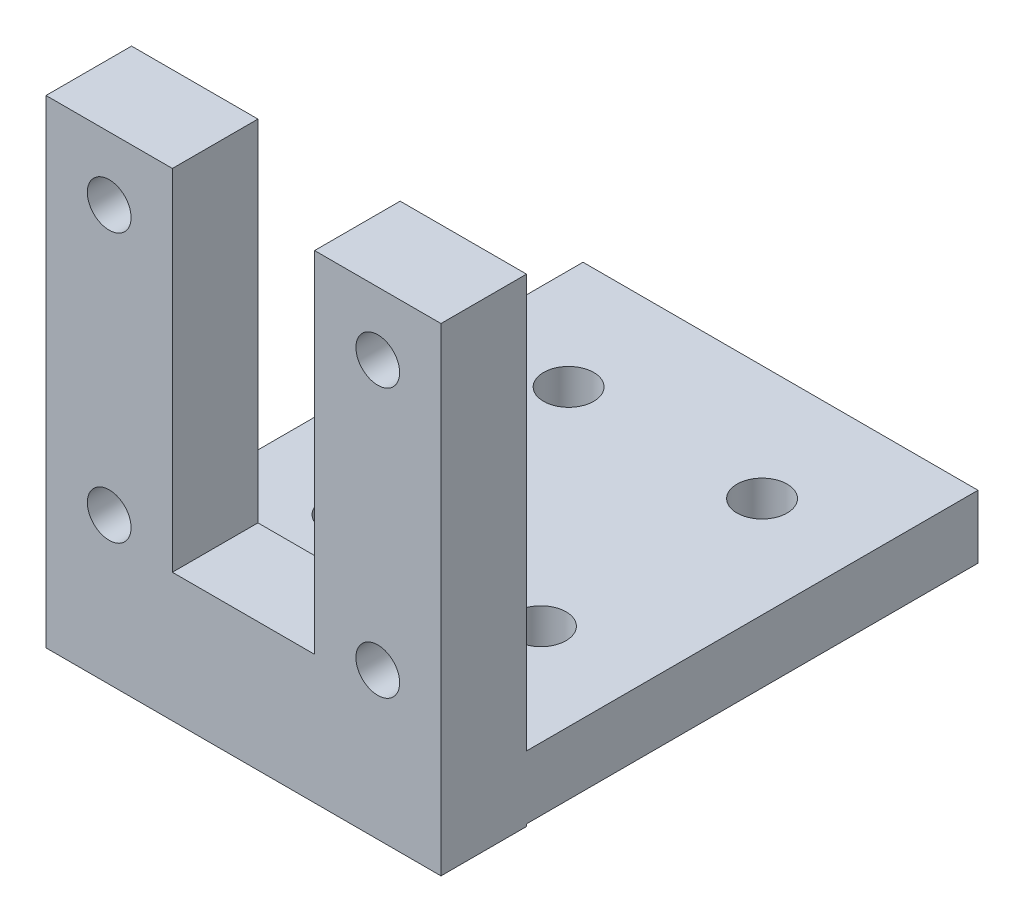
ISO-10303-21;
HEADER;
FILE_DESCRIPTION(('STEP AP214'),'2;1');
FILE_NAME('part.step','',(''),(''),'','','');
FILE_SCHEMA(('AUTOMOTIVE_DESIGN { 1 0 10303 214 1 1 1 1 }'));
ENDSEC;
DATA;
#1=APPLICATION_CONTEXT('core data for automotive mechanical design processes');
#2=APPLICATION_PROTOCOL_DEFINITION('international standard','automotive_design',2000,#1);
#3=PRODUCT_CONTEXT('',#1,'mechanical');
#4=PRODUCT('Part','Part','',(#3));
#5=PRODUCT_RELATED_PRODUCT_CATEGORY('part','',(#4));
#6=PRODUCT_DEFINITION_FORMATION('','',#4);
#7=PRODUCT_DEFINITION_CONTEXT('part definition',#1,'design');
#8=PRODUCT_DEFINITION('design','',#6,#7);
#9=PRODUCT_DEFINITION_SHAPE('','',#8);
#10=(LENGTH_UNIT() NAMED_UNIT(*) SI_UNIT(.MILLI.,.METRE.));
#11=(NAMED_UNIT(*) PLANE_ANGLE_UNIT() SI_UNIT($,.RADIAN.));
#12=(NAMED_UNIT(*) SI_UNIT($,.STERADIAN.) SOLID_ANGLE_UNIT());
#13=UNCERTAINTY_MEASURE_WITH_UNIT(LENGTH_MEASURE(1.E-05),#10,'distance_accuracy_value','');
#14=(GEOMETRIC_REPRESENTATION_CONTEXT(3) GLOBAL_UNCERTAINTY_ASSIGNED_CONTEXT((#13)) GLOBAL_UNIT_ASSIGNED_CONTEXT((#10,
#11,#12)) REPRESENTATION_CONTEXT('',''));
#15=CARTESIAN_POINT('',(0.,0.,0.));
#16=DIRECTION('',(0.,0.,1.));
#17=DIRECTION('',(1.,0.,0.));
#18=AXIS2_PLACEMENT_3D('',#15,#16,#17);
#19=CARTESIAN_POINT('',(-12.5,-9.635,-5.415));
#20=DIRECTION('',(0.,1.,0.));
#21=DIRECTION('',(0.,0.,1.));
#22=AXIS2_PLACEMENT_3D('',#19,#20,#21);
#23=PLANE('',#22);
#24=DIRECTION('',(0.,0.,1.));
#25=VECTOR('',#24,1.);
#26=CARTESIAN_POINT('',(4.5,-9.635,-28.9513171503105));
#27=LINE('',#26,#25);
#28=CARTESIAN_POINT('',(4.5,-9.635,-5.415));
#29=VERTEX_POINT('',#28);
#30=CARTESIAN_POINT('',(4.49999999999999,-9.635,0.));
#31=VERTEX_POINT('',#30);
#32=EDGE_CURVE('E152',#29,#31,#27,.T.);
#33=ORIENTED_EDGE('',*,*,#32,.F.);
#34=DIRECTION('',(-1.,0.,0.));
#35=VECTOR('',#34,1.);
#36=CARTESIAN_POINT('',(-12.5,-9.635,-5.415));
#37=LINE('',#36,#35);
#38=CARTESIAN_POINT('',(-4.49999999999999,-9.635,-5.415));
#39=VERTEX_POINT('',#38);
#40=EDGE_CURVE('E245',#29,#39,#37,.T.);
#41=ORIENTED_EDGE('',*,*,#40,.T.);
#42=DIRECTION('',(0.,0.,1.));
#43=VECTOR('',#42,1.);
#44=CARTESIAN_POINT('',(-4.49999999999999,-9.635,-28.9513171503105));
#45=LINE('',#44,#43);
#46=CARTESIAN_POINT('',(-4.49999999999999,-9.635,0.));
#47=VERTEX_POINT('',#46);
#48=EDGE_CURVE('E175',#39,#47,#45,.T.);
#49=ORIENTED_EDGE('',*,*,#48,.T.);
#50=DIRECTION('',(-1.,0.,0.));
#51=VECTOR('',#50,1.);
#52=CARTESIAN_POINT('',(-12.5,-9.635,0.));
#53=LINE('',#52,#51);
#54=EDGE_CURVE('E53',#31,#47,#53,.T.);
#55=ORIENTED_EDGE('',*,*,#54,.F.);
#56=EDGE_LOOP('',(#33,#41,#49,#55));
#57=FACE_BOUND('',#56,.T.);
#58=ADVANCED_FACE('F33',(#57),#23,.T.);
#59=CARTESIAN_POINT('',(0.,0.,-5.415));
#60=DIRECTION('',(0.,0.,1.));
#61=DIRECTION('',(1.,0.,0.));
#62=AXIS2_PLACEMENT_3D('',#59,#60,#61);
#63=PLANE('',#62);
#64=CARTESIAN_POINT('',(-8.5,-8.49999999999999,-5.415));
#65=DIRECTION('',(0.,0.,1.));
#66=DIRECTION('',(1.,0.,0.));
#67=AXIS2_PLACEMENT_3D('',#64,#65,#66);
#68=CIRCLE('',#67,1.3843);
#69=CARTESIAN_POINT('',(-7.1157,-8.49999999999999,-5.415));
#70=VERTEX_POINT('',#69);
#71=EDGE_CURVE('E329',#70,#70,#68,.F.);
#72=ORIENTED_EDGE('',*,*,#71,.F.);
#73=EDGE_LOOP('',(#72));
#74=FACE_BOUND('',#73,.T.);
#75=CARTESIAN_POINT('',(8.5,-8.5,-5.415));
#76=DIRECTION('',(0.,0.,1.));
#77=DIRECTION('',(1.,0.,0.));
#78=AXIS2_PLACEMENT_3D('',#75,#76,#77);
#79=CIRCLE('',#78,1.3843);
#80=CARTESIAN_POINT('',(9.8843,-8.5,-5.415));
#81=VERTEX_POINT('',#80);
#82=EDGE_CURVE('E148',#81,#81,#79,.F.);
#83=ORIENTED_EDGE('',*,*,#82,.F.);
#84=EDGE_LOOP('',(#83));
#85=FACE_BOUND('',#84,.T.);
#86=DIRECTION('',(1.,0.,0.));
#87=VECTOR('',#86,1.);
#88=CARTESIAN_POINT('',(12.5,-13.635,-5.415));
#89=LINE('',#88,#87);
#90=CARTESIAN_POINT('',(-12.5,-13.635,-5.415));
#91=VERTEX_POINT('',#90);
#92=CARTESIAN_POINT('',(12.5,-13.635,-5.415));
#93=VERTEX_POINT('',#92);
#94=EDGE_CURVE('E213',#91,#93,#89,.T.);
#95=ORIENTED_EDGE('',*,*,#94,.F.);
#96=DIRECTION('',(0.,-1.,0.));
#97=VECTOR('',#96,1.);
#98=CARTESIAN_POINT('',(-12.5,-9.635,-5.415));
#99=LINE('',#98,#97);
#100=CARTESIAN_POINT('',(-12.5,12.5,-5.415));
#101=VERTEX_POINT('',#100);
#102=EDGE_CURVE('E235',#101,#91,#99,.T.);
#103=ORIENTED_EDGE('',*,*,#102,.F.);
#104=DIRECTION('',(1.,0.,0.));
#105=VECTOR('',#104,1.);
#106=CARTESIAN_POINT('',(-12.5,12.5,-5.415));
#107=LINE('',#106,#105);
#108=CARTESIAN_POINT('',(-4.49999999999999,12.5,-5.415));
#109=VERTEX_POINT('',#108);
#110=EDGE_CURVE('E164',#101,#109,#107,.T.);
#111=ORIENTED_EDGE('',*,*,#110,.T.);
#112=DIRECTION('',(0.,-1.,0.));
#113=VECTOR('',#112,1.);
#114=CARTESIAN_POINT('',(-4.49999999999999,-9.635,-5.415));
#115=LINE('',#114,#113);
#116=EDGE_CURVE('E161',#109,#39,#115,.T.);
#117=ORIENTED_EDGE('',*,*,#116,.T.);
#118=ORIENTED_EDGE('',*,*,#40,.F.);
#119=DIRECTION('',(0.,1.,0.));
#120=VECTOR('',#119,1.);
#121=CARTESIAN_POINT('',(4.5,-9.635,-5.415));
#122=LINE('',#121,#120);
#123=CARTESIAN_POINT('',(4.49999999999999,12.5,-5.415));
#124=VERTEX_POINT('',#123);
#125=EDGE_CURVE('E160',#29,#124,#122,.T.);
#126=ORIENTED_EDGE('',*,*,#125,.T.);
#127=DIRECTION('',(1.,0.,0.));
#128=VECTOR('',#127,1.);
#129=CARTESIAN_POINT('',(12.5,12.5,-5.415));
#130=LINE('',#129,#128);
#131=CARTESIAN_POINT('',(12.5,12.5,-5.415));
#132=VERTEX_POINT('',#131);
#133=EDGE_CURVE('E154',#124,#132,#130,.T.);
#134=ORIENTED_EDGE('',*,*,#133,.T.);
#135=DIRECTION('',(0.,1.,0.));
#136=VECTOR('',#135,1.);
#137=CARTESIAN_POINT('',(12.5,-9.635,-5.415));
#138=LINE('',#137,#136);
#139=EDGE_CURVE('E136',#93,#132,#138,.T.);
#140=ORIENTED_EDGE('',*,*,#139,.F.);
#141=EDGE_LOOP('',(#95,#103,#111,#117,#118,#126,#134,#140));
#142=FACE_BOUND('',#141,.T.);
#143=CARTESIAN_POINT('',(-8.49999999999999,8.49999999999999,-5.415));
#144=DIRECTION('',(0.,0.,1.));
#145=DIRECTION('',(1.,0.,0.));
#146=AXIS2_PLACEMENT_3D('',#143,#144,#145);
#147=CIRCLE('',#146,1.3843);
#148=CARTESIAN_POINT('',(-7.1157,8.49999999999999,-5.415));
#149=VERTEX_POINT('',#148);
#150=EDGE_CURVE('E167',#149,#149,#147,.F.);
#151=ORIENTED_EDGE('',*,*,#150,.F.);
#152=EDGE_LOOP('',(#151));
#153=FACE_BOUND('',#152,.T.);
#154=CARTESIAN_POINT('',(8.49999999999999,8.49999999999999,-5.415));
#155=DIRECTION('',(0.,0.,1.));
#156=DIRECTION('',(1.,0.,0.));
#157=AXIS2_PLACEMENT_3D('',#154,#155,#156);
#158=CIRCLE('',#157,1.3843);
#159=CARTESIAN_POINT('',(9.88429999999999,8.49999999999999,-5.415));
#160=VERTEX_POINT('',#159);
#161=EDGE_CURVE('E156',#160,#160,#158,.F.);
#162=ORIENTED_EDGE('',*,*,#161,.F.);
#163=EDGE_LOOP('',(#162));
#164=FACE_BOUND('',#163,.T.);
#165=ADVANCED_FACE('F271',(#74,#85,#142,#153,#164),#63,.F.);
#166=DIRECTION('',(-1.,0.,0.));
#167=VECTOR('',#166,1.);
#168=CARTESIAN_POINT('',(12.5,-17.635,-5.415));
#169=LINE('',#168,#167);
#170=CARTESIAN_POINT('',(12.5,-17.635,-5.415));
#171=VERTEX_POINT('',#170);
#172=CARTESIAN_POINT('',(-12.5,-17.635,-5.415));
#173=VERTEX_POINT('',#172);
#174=EDGE_CURVE('E208',#171,#173,#169,.T.);
#175=ORIENTED_EDGE('',*,*,#174,.F.);
#176=CARTESIAN_POINT('',(12.5,-17.7804600070463,-5.415));
#177=VERTEX_POINT('',#176);
#178=EDGE_CURVE('E242',#177,#171,#138,.T.);
#179=ORIENTED_EDGE('',*,*,#178,.F.);
#180=DIRECTION('',(1.,0.,0.));
#181=VECTOR('',#180,1.);
#182=CARTESIAN_POINT('',(-12.5,-17.7804600070463,-5.415));
#183=LINE('',#182,#181);
#184=CARTESIAN_POINT('',(-12.5,-17.7804600070463,-5.415));
#185=VERTEX_POINT('',#184);
#186=EDGE_CURVE('E238',#185,#177,#183,.T.);
#187=ORIENTED_EDGE('',*,*,#186,.F.);
#188=EDGE_CURVE('E239',#173,#185,#99,.T.);
#189=ORIENTED_EDGE('',*,*,#188,.F.);
#190=EDGE_LOOP('',(#175,#179,#187,#189));
#191=FACE_BOUND('',#190,.T.);
#192=ADVANCED_FACE('F258',(#191),#63,.F.);
#193=CARTESIAN_POINT('',(-12.5,-9.635,-5.415));
#194=DIRECTION('',(-1.,0.,0.));
#195=DIRECTION('',(0.,-1.,0.));
#196=AXIS2_PLACEMENT_3D('',#193,#194,#195);
#197=PLANE('',#196);
#198=DIRECTION('',(0.,-1.,0.));
#199=VECTOR('',#198,1.);
#200=CARTESIAN_POINT('',(-12.5,-9.635,0.));
#201=LINE('',#200,#199);
#202=CARTESIAN_POINT('',(-12.5,12.5,0.));
#203=VERTEX_POINT('',#202);
#204=CARTESIAN_POINT('',(-12.5,-17.7804600070463,0.));
#205=VERTEX_POINT('',#204);
#206=EDGE_CURVE('E234',#203,#205,#201,.T.);
#207=ORIENTED_EDGE('',*,*,#206,.F.);
#208=DIRECTION('',(0.,0.,1.));
#209=VECTOR('',#208,1.);
#210=CARTESIAN_POINT('',(-12.5,12.5,-28.9513171503105));
#211=LINE('',#210,#209);
#212=EDGE_CURVE('E165',#101,#203,#211,.T.);
#213=ORIENTED_EDGE('',*,*,#212,.F.);
#214=ORIENTED_EDGE('',*,*,#102,.T.);
#215=DIRECTION('',(0.,0.,1.));
#216=VECTOR('',#215,1.);
#217=CARTESIAN_POINT('',(-12.5,-13.635,-33.99));
#218=LINE('',#217,#216);
#219=CARTESIAN_POINT('',(-12.5,-13.635,-33.99));
#220=VERTEX_POINT('',#219);
#221=EDGE_CURVE('E225',#220,#91,#218,.T.);
#222=ORIENTED_EDGE('',*,*,#221,.F.);
#223=DIRECTION('',(0.,1.,0.));
#224=VECTOR('',#223,1.);
#225=CARTESIAN_POINT('',(-12.5,-13.635,-33.99));
#226=LINE('',#225,#224);
#227=CARTESIAN_POINT('',(-12.5,-17.635,-33.99));
#228=VERTEX_POINT('',#227);
#229=EDGE_CURVE('E215',#228,#220,#226,.T.);
#230=ORIENTED_EDGE('',*,*,#229,.F.);
#231=DIRECTION('',(0.,0.,1.));
#232=VECTOR('',#231,1.);
#233=CARTESIAN_POINT('',(-12.5,-17.635,-33.99));
#234=LINE('',#233,#232);
#235=EDGE_CURVE('E228',#228,#173,#234,.T.);
#236=ORIENTED_EDGE('',*,*,#235,.T.);
#237=ORIENTED_EDGE('',*,*,#188,.T.);
#238=DIRECTION('',(0.,0.,1.));
#239=VECTOR('',#238,1.);
#240=CARTESIAN_POINT('',(-12.5,-17.7804600070463,-5.415));
#241=LINE('',#240,#239);
#242=EDGE_CURVE('E37',#185,#205,#241,.T.);
#243=ORIENTED_EDGE('',*,*,#242,.T.);
#244=EDGE_LOOP('',(#207,#213,#214,#222,#230,#236,#237,#243));
#245=FACE_BOUND('',#244,.T.);
#246=ADVANCED_FACE('F35',(#245),#197,.T.);
#247=CARTESIAN_POINT('',(12.5,-9.635,-5.415));
#248=DIRECTION('',(1.,0.,0.));
#249=DIRECTION('',(0.,0.,-1.));
#250=AXIS2_PLACEMENT_3D('',#247,#248,#249);
#251=PLANE('',#250);
#252=DIRECTION('',(0.,1.,0.));
#253=VECTOR('',#252,1.);
#254=CARTESIAN_POINT('',(12.5,-9.635,0.));
#255=LINE('',#254,#253);
#256=CARTESIAN_POINT('',(12.5,-17.7804600070463,0.));
#257=VERTEX_POINT('',#256);
#258=CARTESIAN_POINT('',(12.5,12.5,0.));
#259=VERTEX_POINT('',#258);
#260=EDGE_CURVE('E121',#257,#259,#255,.T.);
#261=ORIENTED_EDGE('',*,*,#260,.F.);
#262=DIRECTION('',(0.,0.,1.));
#263=VECTOR('',#262,1.);
#264=CARTESIAN_POINT('',(12.5,-17.7804600070463,-5.415));
#265=LINE('',#264,#263);
#266=EDGE_CURVE('E11',#177,#257,#265,.T.);
#267=ORIENTED_EDGE('',*,*,#266,.F.);
#268=ORIENTED_EDGE('',*,*,#178,.T.);
#269=DIRECTION('',(0.,0.,1.));
#270=VECTOR('',#269,1.);
#271=CARTESIAN_POINT('',(12.5,-17.635,-33.99));
#272=LINE('',#271,#270);
#273=CARTESIAN_POINT('',(12.5,-17.635,-33.99));
#274=VERTEX_POINT('',#273);
#275=EDGE_CURVE('E231',#274,#171,#272,.T.);
#276=ORIENTED_EDGE('',*,*,#275,.F.);
#277=DIRECTION('',(0.,-1.,0.));
#278=VECTOR('',#277,1.);
#279=CARTESIAN_POINT('',(12.5,-13.635,-33.99));
#280=LINE('',#279,#278);
#281=CARTESIAN_POINT('',(12.5,-13.635,-33.99));
#282=VERTEX_POINT('',#281);
#283=EDGE_CURVE('E209',#282,#274,#280,.T.);
#284=ORIENTED_EDGE('',*,*,#283,.F.);
#285=DIRECTION('',(0.,0.,1.));
#286=VECTOR('',#285,1.);
#287=CARTESIAN_POINT('',(12.5,-13.635,-33.99));
#288=LINE('',#287,#286);
#289=EDGE_CURVE('E219',#282,#93,#288,.T.);
#290=ORIENTED_EDGE('',*,*,#289,.T.);
#291=ORIENTED_EDGE('',*,*,#139,.T.);
#292=DIRECTION('',(0.,0.,1.));
#293=VECTOR('',#292,1.);
#294=CARTESIAN_POINT('',(12.5,12.5,-28.9513171503105));
#295=LINE('',#294,#293);
#296=EDGE_CURVE('E133',#132,#259,#295,.T.);
#297=ORIENTED_EDGE('',*,*,#296,.T.);
#298=EDGE_LOOP('',(#261,#267,#268,#276,#284,#290,#291,#297));
#299=FACE_BOUND('',#298,.T.);
#300=ADVANCED_FACE('F134',(#299),#251,.T.);
#301=CARTESIAN_POINT('',(-12.5,-17.7804600070463,-5.415));
#302=DIRECTION('',(0.,-1.,0.));
#303=DIRECTION('',(0.,0.,-1.));
#304=AXIS2_PLACEMENT_3D('',#301,#302,#303);
#305=PLANE('',#304);
#306=DIRECTION('',(1.,0.,0.));
#307=VECTOR('',#306,1.);
#308=CARTESIAN_POINT('',(-12.5,-17.7804600070463,0.));
#309=LINE('',#308,#307);
#310=EDGE_CURVE('E129',#205,#257,#309,.T.);
#311=ORIENTED_EDGE('',*,*,#310,.F.);
#312=ORIENTED_EDGE('',*,*,#242,.F.);
#313=ORIENTED_EDGE('',*,*,#186,.T.);
#314=ORIENTED_EDGE('',*,*,#266,.T.);
#315=EDGE_LOOP('',(#311,#312,#313,#314));
#316=FACE_BOUND('',#315,.T.);
#317=ADVANCED_FACE('F256',(#316),#305,.T.);
#318=CARTESIAN_POINT('',(0.,0.,0.));
#319=DIRECTION('',(0.,0.,1.));
#320=DIRECTION('',(1.,0.,0.));
#321=AXIS2_PLACEMENT_3D('',#318,#319,#320);
#322=PLANE('',#321);
#323=CARTESIAN_POINT('',(-8.5,-8.49999999999999,0.));
#324=DIRECTION('',(0.,0.,1.));
#325=DIRECTION('',(1.,0.,0.));
#326=AXIS2_PLACEMENT_3D('',#323,#324,#325);
#327=CIRCLE('',#326,1.3843);
#328=CARTESIAN_POINT('',(-7.1157,-8.49999999999999,0.));
#329=VERTEX_POINT('',#328);
#330=EDGE_CURVE('E324',#329,#329,#327,.T.);
#331=ORIENTED_EDGE('',*,*,#330,.F.);
#332=EDGE_LOOP('',(#331));
#333=FACE_BOUND('',#332,.T.);
#334=CARTESIAN_POINT('',(8.5,-8.5,0.));
#335=DIRECTION('',(0.,0.,1.));
#336=DIRECTION('',(1.,0.,0.));
#337=AXIS2_PLACEMENT_3D('',#334,#335,#336);
#338=CIRCLE('',#337,1.3843);
#339=CARTESIAN_POINT('',(9.8843,-8.5,0.));
#340=VERTEX_POINT('',#339);
#341=EDGE_CURVE('E327',#340,#340,#338,.T.);
#342=ORIENTED_EDGE('',*,*,#341,.F.);
#343=EDGE_LOOP('',(#342));
#344=FACE_BOUND('',#343,.T.);
#345=ORIENTED_EDGE('',*,*,#206,.T.);
#346=ORIENTED_EDGE('',*,*,#310,.T.);
#347=ORIENTED_EDGE('',*,*,#260,.T.);
#348=DIRECTION('',(-1.,0.,0.));
#349=VECTOR('',#348,1.);
#350=CARTESIAN_POINT('',(12.5,12.5,0.));
#351=LINE('',#350,#349);
#352=CARTESIAN_POINT('',(4.49999999999999,12.5,0.));
#353=VERTEX_POINT('',#352);
#354=EDGE_CURVE('E127',#259,#353,#351,.T.);
#355=ORIENTED_EDGE('',*,*,#354,.T.);
#356=DIRECTION('',(0.,-1.,0.));
#357=VECTOR('',#356,1.);
#358=CARTESIAN_POINT('',(4.5,-9.635,0.));
#359=LINE('',#358,#357);
#360=EDGE_CURVE('E48',#353,#31,#359,.T.);
#361=ORIENTED_EDGE('',*,*,#360,.T.);
#362=ORIENTED_EDGE('',*,*,#54,.T.);
#363=DIRECTION('',(0.,1.,0.));
#364=VECTOR('',#363,1.);
#365=CARTESIAN_POINT('',(-4.49999999999999,-9.635,0.));
#366=LINE('',#365,#364);
#367=CARTESIAN_POINT('',(-4.49999999999999,12.5,0.));
#368=VERTEX_POINT('',#367);
#369=EDGE_CURVE('E170',#47,#368,#366,.T.);
#370=ORIENTED_EDGE('',*,*,#369,.T.);
#371=DIRECTION('',(-1.,0.,0.));
#372=VECTOR('',#371,1.);
#373=CARTESIAN_POINT('',(-12.5,12.5,0.));
#374=LINE('',#373,#372);
#375=EDGE_CURVE('E172',#368,#203,#374,.T.);
#376=ORIENTED_EDGE('',*,*,#375,.T.);
#377=EDGE_LOOP('',(#345,#346,#347,#355,#361,#362,#370,#376));
#378=FACE_BOUND('',#377,.T.);
#379=CARTESIAN_POINT('',(-8.49999999999999,8.49999999999999,0.));
#380=DIRECTION('',(0.,0.,1.));
#381=DIRECTION('',(1.,0.,0.));
#382=AXIS2_PLACEMENT_3D('',#379,#380,#381);
#383=CIRCLE('',#382,1.3843);
#384=CARTESIAN_POINT('',(-7.1157,8.49999999999999,0.));
#385=VERTEX_POINT('',#384);
#386=EDGE_CURVE('E159',#385,#385,#383,.T.);
#387=ORIENTED_EDGE('',*,*,#386,.F.);
#388=EDGE_LOOP('',(#387));
#389=FACE_BOUND('',#388,.T.);
#390=CARTESIAN_POINT('',(8.49999999999999,8.49999999999999,0.));
#391=DIRECTION('',(0.,0.,1.));
#392=DIRECTION('',(-1.,0.,0.));
#393=AXIS2_PLACEMENT_3D('',#390,#391,#392);
#394=CIRCLE('',#393,1.3843);
#395=CARTESIAN_POINT('',(7.1157,8.49999999999999,0.));
#396=VERTEX_POINT('',#395);
#397=EDGE_CURVE('E144',#396,#396,#394,.T.);
#398=ORIENTED_EDGE('',*,*,#397,.F.);
#399=EDGE_LOOP('',(#398));
#400=FACE_BOUND('',#399,.T.);
#401=ADVANCED_FACE('F124',(#333,#344,#378,#389,#400),#322,.T.);
#402=CARTESIAN_POINT('',(12.5,-17.635,-33.99));
#403=DIRECTION('',(0.,1.,0.));
#404=DIRECTION('',(-1.,0.,0.));
#405=AXIS2_PLACEMENT_3D('',#402,#403,#404);
#406=PLANE('',#405);
#407=CARTESIAN_POINT('',(6.12204724409449,-17.635,-12.705));
#408=DIRECTION('',(0.,1.,0.));
#409=DIRECTION('',(-1.,0.,0.));
#410=AXIS2_PLACEMENT_3D('',#407,#408,#409);
#411=CIRCLE('',#410,1.5875);
#412=CARTESIAN_POINT('',(4.53454724409449,-17.635,-12.705));
#413=VERTEX_POINT('',#412);
#414=EDGE_CURVE('E199',#413,#413,#411,.T.);
#415=ORIENTED_EDGE('',*,*,#414,.T.);
#416=EDGE_LOOP('',(#415));
#417=FACE_BOUND('',#416,.T.);
#418=CARTESIAN_POINT('',(6.12204724409449,-17.635,-26.7));
#419=DIRECTION('',(0.,1.,0.));
#420=DIRECTION('',(-1.,0.,0.));
#421=AXIS2_PLACEMENT_3D('',#418,#419,#420);
#422=CIRCLE('',#421,1.5875);
#423=CARTESIAN_POINT('',(4.53454724409449,-17.635,-26.7));
#424=VERTEX_POINT('',#423);
#425=EDGE_CURVE('E196',#424,#424,#422,.T.);
#426=ORIENTED_EDGE('',*,*,#425,.T.);
#427=EDGE_LOOP('',(#426));
#428=FACE_BOUND('',#427,.T.);
#429=CARTESIAN_POINT('',(-6.12204724409449,-17.635,-26.7));
#430=DIRECTION('',(0.,1.,0.));
#431=DIRECTION('',(-1.,0.,0.));
#432=AXIS2_PLACEMENT_3D('',#429,#430,#431);
#433=CIRCLE('',#432,1.5875);
#434=CARTESIAN_POINT('',(-7.70954724409449,-17.635,-26.7));
#435=VERTEX_POINT('',#434);
#436=EDGE_CURVE('E188',#435,#435,#433,.T.);
#437=ORIENTED_EDGE('',*,*,#436,.T.);
#438=EDGE_LOOP('',(#437));
#439=FACE_BOUND('',#438,.T.);
#440=CARTESIAN_POINT('',(-6.12204724409449,-17.635,-12.705));
#441=DIRECTION('',(0.,1.,0.));
#442=DIRECTION('',(-1.,0.,0.));
#443=AXIS2_PLACEMENT_3D('',#440,#441,#442);
#444=CIRCLE('',#443,1.5875);
#445=CARTESIAN_POINT('',(-7.70954724409449,-17.635,-12.705));
#446=VERTEX_POINT('',#445);
#447=EDGE_CURVE('E205',#446,#446,#444,.T.);
#448=ORIENTED_EDGE('',*,*,#447,.T.);
#449=EDGE_LOOP('',(#448));
#450=FACE_BOUND('',#449,.T.);
#451=ORIENTED_EDGE('',*,*,#174,.T.);
#452=ORIENTED_EDGE('',*,*,#235,.F.);
#453=DIRECTION('',(-1.,0.,0.));
#454=VECTOR('',#453,1.);
#455=CARTESIAN_POINT('',(12.5,-17.635,-33.99));
#456=LINE('',#455,#454);
#457=EDGE_CURVE('E212',#274,#228,#456,.T.);
#458=ORIENTED_EDGE('',*,*,#457,.F.);
#459=ORIENTED_EDGE('',*,*,#275,.T.);
#460=EDGE_LOOP('',(#451,#452,#458,#459));
#461=FACE_BOUND('',#460,.T.);
#462=ADVANCED_FACE('F262',(#417,#428,#439,#450,#461),#406,.F.);
#463=CARTESIAN_POINT('',(12.5,-13.635,-33.99));
#464=DIRECTION('',(0.,-1.,0.));
#465=DIRECTION('',(1.,0.,0.));
#466=AXIS2_PLACEMENT_3D('',#463,#464,#465);
#467=PLANE('',#466);
#468=CARTESIAN_POINT('',(6.12204724409449,-13.635,-12.705));
#469=DIRECTION('',(0.,1.,0.));
#470=DIRECTION('',(0.,0.,1.));
#471=AXIS2_PLACEMENT_3D('',#468,#469,#470);
#472=CIRCLE('',#471,1.5875);
#473=CARTESIAN_POINT('',(6.12204724409449,-13.635,-11.1175));
#474=VERTEX_POINT('',#473);
#475=EDGE_CURVE('E185',#474,#474,#472,.T.);
#476=ORIENTED_EDGE('',*,*,#475,.F.);
#477=EDGE_LOOP('',(#476));
#478=FACE_BOUND('',#477,.T.);
#479=CARTESIAN_POINT('',(6.12204724409449,-13.635,-26.7));
#480=DIRECTION('',(0.,1.,0.));
#481=DIRECTION('',(0.,0.,1.));
#482=AXIS2_PLACEMENT_3D('',#479,#480,#481);
#483=CIRCLE('',#482,1.5875);
#484=CARTESIAN_POINT('',(6.12204724409449,-13.635,-25.1125));
#485=VERTEX_POINT('',#484);
#486=EDGE_CURVE('E189',#485,#485,#483,.T.);
#487=ORIENTED_EDGE('',*,*,#486,.F.);
#488=EDGE_LOOP('',(#487));
#489=FACE_BOUND('',#488,.T.);
#490=CARTESIAN_POINT('',(-6.12204724409449,-13.635,-26.7));
#491=DIRECTION('',(0.,1.,0.));
#492=DIRECTION('',(0.,0.,1.));
#493=AXIS2_PLACEMENT_3D('',#490,#491,#492);
#494=CIRCLE('',#493,1.5875);
#495=CARTESIAN_POINT('',(-6.12204724409449,-13.635,-25.1125));
#496=VERTEX_POINT('',#495);
#497=EDGE_CURVE('E184',#496,#496,#494,.T.);
#498=ORIENTED_EDGE('',*,*,#497,.F.);
#499=EDGE_LOOP('',(#498));
#500=FACE_BOUND('',#499,.T.);
#501=CARTESIAN_POINT('',(-6.12204724409449,-13.635,-12.705));
#502=DIRECTION('',(0.,1.,0.));
#503=DIRECTION('',(0.,0.,1.));
#504=AXIS2_PLACEMENT_3D('',#501,#502,#503);
#505=CIRCLE('',#504,1.5875);
#506=CARTESIAN_POINT('',(-6.12204724409449,-13.635,-11.1175));
#507=VERTEX_POINT('',#506);
#508=EDGE_CURVE('E202',#507,#507,#505,.T.);
#509=ORIENTED_EDGE('',*,*,#508,.F.);
#510=EDGE_LOOP('',(#509));
#511=FACE_BOUND('',#510,.T.);
#512=ORIENTED_EDGE('',*,*,#94,.T.);
#513=ORIENTED_EDGE('',*,*,#289,.F.);
#514=DIRECTION('',(1.,0.,0.));
#515=VECTOR('',#514,1.);
#516=CARTESIAN_POINT('',(12.5,-13.635,-33.99));
#517=LINE('',#516,#515);
#518=EDGE_CURVE('E217',#220,#282,#517,.T.);
#519=ORIENTED_EDGE('',*,*,#518,.F.);
#520=ORIENTED_EDGE('',*,*,#221,.T.);
#521=EDGE_LOOP('',(#512,#513,#519,#520));
#522=FACE_BOUND('',#521,.T.);
#523=ADVANCED_FACE('F268',(#478,#489,#500,#511,#522),#467,.F.);
#524=CARTESIAN_POINT('',(0.,0.,-33.99));
#525=DIRECTION('',(0.,0.,-1.));
#526=DIRECTION('',(-1.,0.,0.));
#527=AXIS2_PLACEMENT_3D('',#524,#525,#526);
#528=PLANE('',#527);
#529=ORIENTED_EDGE('',*,*,#283,.T.);
#530=ORIENTED_EDGE('',*,*,#457,.T.);
#531=ORIENTED_EDGE('',*,*,#229,.T.);
#532=ORIENTED_EDGE('',*,*,#518,.T.);
#533=EDGE_LOOP('',(#529,#530,#531,#532));
#534=FACE_BOUND('',#533,.T.);
#535=ADVANCED_FACE('F264',(#534),#528,.T.);
#536=CARTESIAN_POINT('',(-6.12204724409449,-22.2705880675809,-12.705));
#537=DIRECTION('',(0.,1.,0.));
#538=DIRECTION('',(0.,0.,1.));
#539=AXIS2_PLACEMENT_3D('',#536,#537,#538);
#540=CYLINDRICAL_SURFACE('',#539,1.5875);
#541=ORIENTED_EDGE('',*,*,#508,.T.);
#542=EDGE_LOOP('',(#541));
#543=FACE_BOUND('',#542,.T.);
#544=ORIENTED_EDGE('',*,*,#447,.F.);
#545=EDGE_LOOP('',(#544));
#546=FACE_BOUND('',#545,.T.);
#547=ADVANCED_FACE('F434',(#543,#546),#540,.F.);
#548=CARTESIAN_POINT('',(-6.12204724409449,-22.2705880675809,-26.7));
#549=DIRECTION('',(0.,1.,0.));
#550=DIRECTION('',(0.,0.,1.));
#551=AXIS2_PLACEMENT_3D('',#548,#549,#550);
#552=CYLINDRICAL_SURFACE('',#551,1.5875);
#553=ORIENTED_EDGE('',*,*,#497,.T.);
#554=EDGE_LOOP('',(#553));
#555=FACE_BOUND('',#554,.T.);
#556=ORIENTED_EDGE('',*,*,#436,.F.);
#557=EDGE_LOOP('',(#556));
#558=FACE_BOUND('',#557,.T.);
#559=ADVANCED_FACE('F426',(#555,#558),#552,.F.);
#560=CARTESIAN_POINT('',(6.12204724409449,-22.2705880675809,-26.7));
#561=DIRECTION('',(0.,1.,0.));
#562=DIRECTION('',(0.,0.,1.));
#563=AXIS2_PLACEMENT_3D('',#560,#561,#562);
#564=CYLINDRICAL_SURFACE('',#563,1.5875);
#565=ORIENTED_EDGE('',*,*,#486,.T.);
#566=EDGE_LOOP('',(#565));
#567=FACE_BOUND('',#566,.T.);
#568=ORIENTED_EDGE('',*,*,#425,.F.);
#569=EDGE_LOOP('',(#568));
#570=FACE_BOUND('',#569,.T.);
#571=ADVANCED_FACE('F418',(#567,#570),#564,.F.);
#572=CARTESIAN_POINT('',(6.12204724409449,-22.2705880675809,-12.705));
#573=DIRECTION('',(0.,1.,0.));
#574=DIRECTION('',(0.,0.,1.));
#575=AXIS2_PLACEMENT_3D('',#572,#573,#574);
#576=CYLINDRICAL_SURFACE('',#575,1.5875);
#577=ORIENTED_EDGE('',*,*,#475,.T.);
#578=EDGE_LOOP('',(#577));
#579=FACE_BOUND('',#578,.T.);
#580=ORIENTED_EDGE('',*,*,#414,.F.);
#581=EDGE_LOOP('',(#580));
#582=FACE_BOUND('',#581,.T.);
#583=ADVANCED_FACE('F386',(#579,#582),#576,.F.);
#584=CARTESIAN_POINT('',(-4.49999999999999,-9.635,-28.9513171503105));
#585=DIRECTION('',(1.,0.,0.));
#586=DIRECTION('',(0.,0.,-1.));
#587=AXIS2_PLACEMENT_3D('',#584,#585,#586);
#588=PLANE('',#587);
#589=ORIENTED_EDGE('',*,*,#116,.F.);
#590=DIRECTION('',(0.,0.,1.));
#591=VECTOR('',#590,1.);
#592=CARTESIAN_POINT('',(-4.49999999999999,12.5,-28.9513171503105));
#593=LINE('',#592,#591);
#594=EDGE_CURVE('E178',#109,#368,#593,.T.);
#595=ORIENTED_EDGE('',*,*,#594,.T.);
#596=ORIENTED_EDGE('',*,*,#369,.F.);
#597=ORIENTED_EDGE('',*,*,#48,.F.);
#598=EDGE_LOOP('',(#589,#595,#596,#597));
#599=FACE_BOUND('',#598,.T.);
#600=ADVANCED_FACE('F282',(#599),#588,.T.);
#601=CARTESIAN_POINT('',(-12.5,12.5,-28.9513171503105));
#602=DIRECTION('',(0.,1.,0.));
#603=DIRECTION('',(-1.,0.,0.));
#604=AXIS2_PLACEMENT_3D('',#601,#602,#603);
#605=PLANE('',#604);
#606=ORIENTED_EDGE('',*,*,#110,.F.);
#607=ORIENTED_EDGE('',*,*,#212,.T.);
#608=ORIENTED_EDGE('',*,*,#375,.F.);
#609=ORIENTED_EDGE('',*,*,#594,.F.);
#610=EDGE_LOOP('',(#606,#607,#608,#609));
#611=FACE_BOUND('',#610,.T.);
#612=ADVANCED_FACE('F277',(#611),#605,.T.);
#613=CARTESIAN_POINT('',(-8.49999999999999,8.49999999999999,-28.9513171503105));
#614=DIRECTION('',(0.,0.,1.));
#615=DIRECTION('',(1.,0.,0.));
#616=AXIS2_PLACEMENT_3D('',#613,#614,#615);
#617=CYLINDRICAL_SURFACE('',#616,1.3843);
#618=ORIENTED_EDGE('',*,*,#150,.T.);
#619=EDGE_LOOP('',(#618));
#620=FACE_BOUND('',#619,.T.);
#621=ORIENTED_EDGE('',*,*,#386,.T.);
#622=EDGE_LOOP('',(#621));
#623=FACE_BOUND('',#622,.T.);
#624=ADVANCED_FACE('F299',(#620,#623),#617,.F.);
#625=CARTESIAN_POINT('',(12.5,12.5,-28.9513171503105));
#626=DIRECTION('',(0.,1.,0.));
#627=DIRECTION('',(-1.,0.,0.));
#628=AXIS2_PLACEMENT_3D('',#625,#626,#627);
#629=PLANE('',#628);
#630=ORIENTED_EDGE('',*,*,#133,.F.);
#631=DIRECTION('',(0.,0.,1.));
#632=VECTOR('',#631,1.);
#633=CARTESIAN_POINT('',(4.49999999999999,12.5,-28.9513171503105));
#634=LINE('',#633,#632);
#635=EDGE_CURVE('E140',#124,#353,#634,.T.);
#636=ORIENTED_EDGE('',*,*,#635,.T.);
#637=ORIENTED_EDGE('',*,*,#354,.F.);
#638=ORIENTED_EDGE('',*,*,#296,.F.);
#639=EDGE_LOOP('',(#630,#636,#637,#638));
#640=FACE_BOUND('',#639,.T.);
#641=ADVANCED_FACE('F142',(#640),#629,.T.);
#642=CARTESIAN_POINT('',(4.5,-9.635,-28.9513171503105));
#643=DIRECTION('',(-1.,0.,0.));
#644=DIRECTION('',(0.,-1.,0.));
#645=AXIS2_PLACEMENT_3D('',#642,#643,#644);
#646=PLANE('',#645);
#647=ORIENTED_EDGE('',*,*,#125,.F.);
#648=ORIENTED_EDGE('',*,*,#32,.T.);
#649=ORIENTED_EDGE('',*,*,#360,.F.);
#650=ORIENTED_EDGE('',*,*,#635,.F.);
#651=EDGE_LOOP('',(#647,#648,#649,#650));
#652=FACE_BOUND('',#651,.T.);
#653=ADVANCED_FACE('F288',(#652),#646,.T.);
#654=CARTESIAN_POINT('',(8.49999999999999,8.49999999999999,-28.9513171503105));
#655=DIRECTION('',(0.,0.,1.));
#656=DIRECTION('',(1.,0.,0.));
#657=AXIS2_PLACEMENT_3D('',#654,#655,#656);
#658=CYLINDRICAL_SURFACE('',#657,1.3843);
#659=ORIENTED_EDGE('',*,*,#161,.T.);
#660=EDGE_LOOP('',(#659));
#661=FACE_BOUND('',#660,.T.);
#662=ORIENTED_EDGE('',*,*,#397,.T.);
#663=EDGE_LOOP('',(#662));
#664=FACE_BOUND('',#663,.T.);
#665=ADVANCED_FACE('F290',(#661,#664),#658,.F.);
#666=CARTESIAN_POINT('',(8.5,-8.5,-9.33039166878616));
#667=DIRECTION('',(0.,0.,1.));
#668=DIRECTION('',(1.,0.,0.));
#669=AXIS2_PLACEMENT_3D('',#666,#667,#668);
#670=CYLINDRICAL_SURFACE('',#669,1.3843);
#671=ORIENTED_EDGE('',*,*,#82,.T.);
#672=EDGE_LOOP('',(#671));
#673=FACE_BOUND('',#672,.T.);
#674=ORIENTED_EDGE('',*,*,#341,.T.);
#675=EDGE_LOOP('',(#674));
#676=FACE_BOUND('',#675,.T.);
#677=ADVANCED_FACE('F296',(#673,#676),#670,.F.);
#678=CARTESIAN_POINT('',(-8.5,-8.49999999999999,-9.33039166878616));
#679=DIRECTION('',(0.,0.,1.));
#680=DIRECTION('',(1.,0.,0.));
#681=AXIS2_PLACEMENT_3D('',#678,#679,#680);
#682=CYLINDRICAL_SURFACE('',#681,1.3843);
#683=ORIENTED_EDGE('',*,*,#71,.T.);
#684=EDGE_LOOP('',(#683));
#685=FACE_BOUND('',#684,.T.);
#686=ORIENTED_EDGE('',*,*,#330,.T.);
#687=EDGE_LOOP('',(#686));
#688=FACE_BOUND('',#687,.T.);
#689=ADVANCED_FACE('F337',(#685,#688),#682,.F.);
#690=CLOSED_SHELL('',(#58,#165,#192,#246,#300,#317,#401,#462,#523,#535,#547,#559,#571,#583,#600,
#612,#624,#641,#653,#665,#677,#689));
#691=MANIFOLD_SOLID_BREP('B2',#690);
#692=ADVANCED_BREP_SHAPE_REPRESENTATION('',(#18,#691),#14);
#693=SHAPE_DEFINITION_REPRESENTATION(#9,#692);
ENDSEC;
END-ISO-10303-21;
